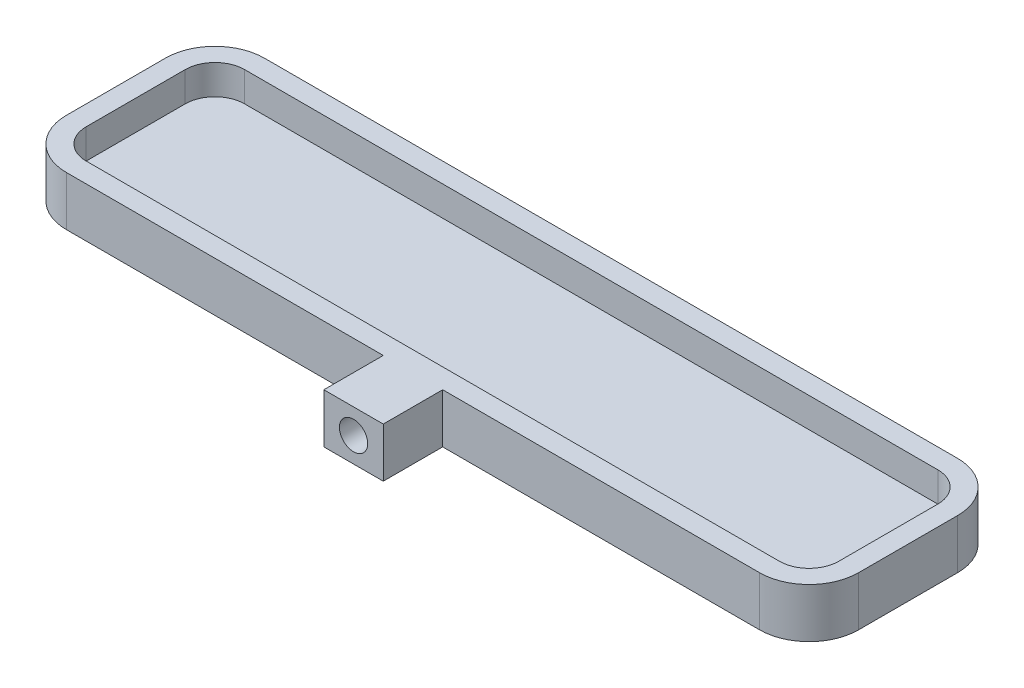
ISO-10303-21;
HEADER;
FILE_DESCRIPTION(('STEP AP214'),'2;1');
FILE_NAME('part.step','',(''),(''),'','','');
FILE_SCHEMA(('AUTOMOTIVE_DESIGN { 1 0 10303 214 1 1 1 1 }'));
ENDSEC;
DATA;
#1=APPLICATION_CONTEXT('core data for automotive mechanical design processes');
#2=APPLICATION_PROTOCOL_DEFINITION('international standard','automotive_design',2000,#1);
#3=PRODUCT_CONTEXT('',#1,'mechanical');
#4=PRODUCT('Part','Part','',(#3));
#5=PRODUCT_RELATED_PRODUCT_CATEGORY('part','',(#4));
#6=PRODUCT_DEFINITION_FORMATION('','',#4);
#7=PRODUCT_DEFINITION_CONTEXT('part definition',#1,'design');
#8=PRODUCT_DEFINITION('design','',#6,#7);
#9=PRODUCT_DEFINITION_SHAPE('','',#8);
#10=(LENGTH_UNIT() NAMED_UNIT(*) SI_UNIT(.MILLI.,.METRE.));
#11=(NAMED_UNIT(*) PLANE_ANGLE_UNIT() SI_UNIT($,.RADIAN.));
#12=(NAMED_UNIT(*) SI_UNIT($,.STERADIAN.) SOLID_ANGLE_UNIT());
#13=UNCERTAINTY_MEASURE_WITH_UNIT(LENGTH_MEASURE(1.E-05),#10,'distance_accuracy_value','');
#14=(GEOMETRIC_REPRESENTATION_CONTEXT(3) GLOBAL_UNCERTAINTY_ASSIGNED_CONTEXT((#13)) GLOBAL_UNIT_ASSIGNED_CONTEXT((#10,
#11,#12)) REPRESENTATION_CONTEXT('',''));
#15=CARTESIAN_POINT('',(0.,0.,0.));
#16=DIRECTION('',(0.,0.,1.));
#17=DIRECTION('',(1.,0.,0.));
#18=AXIS2_PLACEMENT_3D('',#15,#16,#17);
#19=CARTESIAN_POINT('',(-40.,5.,10.));
#20=DIRECTION('',(0.,0.,-1.));
#21=DIRECTION('',(-1.,0.,0.));
#22=AXIS2_PLACEMENT_3D('',#19,#20,#21);
#23=PLANE('',#22);
#24=DIRECTION('',(0.,-1.,0.));
#25=VECTOR('',#24,1.);
#26=CARTESIAN_POINT('',(-3.,5.,10.));
#27=LINE('',#26,#25);
#28=CARTESIAN_POINT('',(-3.,5.,10.));
#29=VERTEX_POINT('',#28);
#30=CARTESIAN_POINT('',(-3.,0.,10.));
#31=VERTEX_POINT('',#30);
#32=EDGE_CURVE('E63',#29,#31,#27,.T.);
#33=ORIENTED_EDGE('',*,*,#32,.F.);
#34=DIRECTION('',(1.,0.,0.));
#35=VECTOR('',#34,1.);
#36=CARTESIAN_POINT('',(-40.,5.,10.));
#37=LINE('',#36,#35);
#38=CARTESIAN_POINT('',(-35.,5.,10.));
#39=VERTEX_POINT('',#38);
#40=EDGE_CURVE('E309',#39,#29,#37,.T.);
#41=ORIENTED_EDGE('',*,*,#40,.F.);
#42=DIRECTION('',(0.,-1.,0.));
#43=VECTOR('',#42,1.);
#44=CARTESIAN_POINT('',(-35.,5.,10.));
#45=LINE('',#44,#43);
#46=CARTESIAN_POINT('',(-35.,0.,10.));
#47=VERTEX_POINT('',#46);
#48=EDGE_CURVE('E368',#39,#47,#45,.T.);
#49=ORIENTED_EDGE('',*,*,#48,.T.);
#50=DIRECTION('',(1.,0.,0.));
#51=VECTOR('',#50,1.);
#52=CARTESIAN_POINT('',(-40.,0.,10.));
#53=LINE('',#52,#51);
#54=EDGE_CURVE('E301',#47,#31,#53,.T.);
#55=ORIENTED_EDGE('',*,*,#54,.T.);
#56=EDGE_LOOP('',(#33,#41,#49,#55));
#57=FACE_BOUND('',#56,.T.);
#58=ADVANCED_FACE('F39',(#57),#23,.F.);
#59=DIRECTION('',(0.,1.,0.));
#60=VECTOR('',#59,1.);
#61=CARTESIAN_POINT('',(3.,5.,10.));
#62=LINE('',#61,#60);
#63=CARTESIAN_POINT('',(3.,0.,10.));
#64=VERTEX_POINT('',#63);
#65=CARTESIAN_POINT('',(3.,5.,10.));
#66=VERTEX_POINT('',#65);
#67=EDGE_CURVE('E201',#64,#66,#62,.T.);
#68=ORIENTED_EDGE('',*,*,#67,.F.);
#69=CARTESIAN_POINT('',(35.,0.,10.));
#70=VERTEX_POINT('',#69);
#71=EDGE_CURVE('E324',#64,#70,#53,.T.);
#72=ORIENTED_EDGE('',*,*,#71,.T.);
#73=DIRECTION('',(0.,-1.,0.));
#74=VECTOR('',#73,1.);
#75=CARTESIAN_POINT('',(35.,5.,10.));
#76=LINE('',#75,#74);
#77=CARTESIAN_POINT('',(35.,5.,10.));
#78=VERTEX_POINT('',#77);
#79=EDGE_CURVE('E365',#70,#78,#76,.F.);
#80=ORIENTED_EDGE('',*,*,#79,.T.);
#81=EDGE_CURVE('E55',#66,#78,#37,.T.);
#82=ORIENTED_EDGE('',*,*,#81,.F.);
#83=EDGE_LOOP('',(#68,#72,#80,#82));
#84=FACE_BOUND('',#83,.T.);
#85=ADVANCED_FACE('F445',(#84),#23,.F.);
#86=CARTESIAN_POINT('',(40.,5.,10.));
#87=DIRECTION('',(-1.,0.,0.));
#88=DIRECTION('',(0.,0.,1.));
#89=AXIS2_PLACEMENT_3D('',#86,#87,#88);
#90=PLANE('',#89);
#91=DIRECTION('',(0.,0.,-1.));
#92=VECTOR('',#91,1.);
#93=CARTESIAN_POINT('',(40.,0.,10.));
#94=LINE('',#93,#92);
#95=CARTESIAN_POINT('',(40.,0.,5.));
#96=VERTEX_POINT('',#95);
#97=CARTESIAN_POINT('',(40.,0.,-5.));
#98=VERTEX_POINT('',#97);
#99=EDGE_CURVE('E220',#96,#98,#94,.T.);
#100=ORIENTED_EDGE('',*,*,#99,.T.);
#101=DIRECTION('',(0.,-1.,0.));
#102=VECTOR('',#101,1.);
#103=CARTESIAN_POINT('',(40.,5.,-5.));
#104=LINE('',#103,#102);
#105=CARTESIAN_POINT('',(40.,5.,-5.));
#106=VERTEX_POINT('',#105);
#107=EDGE_CURVE('E11',#98,#106,#104,.F.);
#108=ORIENTED_EDGE('',*,*,#107,.T.);
#109=DIRECTION('',(0.,0.,-1.));
#110=VECTOR('',#109,1.);
#111=CARTESIAN_POINT('',(40.,5.,10.));
#112=LINE('',#111,#110);
#113=CARTESIAN_POINT('',(40.,5.,5.));
#114=VERTEX_POINT('',#113);
#115=EDGE_CURVE('E296',#114,#106,#112,.T.);
#116=ORIENTED_EDGE('',*,*,#115,.F.);
#117=DIRECTION('',(0.,-1.,0.));
#118=VECTOR('',#117,1.);
#119=CARTESIAN_POINT('',(40.,5.,5.));
#120=LINE('',#119,#118);
#121=EDGE_CURVE('E48',#114,#96,#120,.T.);
#122=ORIENTED_EDGE('',*,*,#121,.T.);
#123=EDGE_LOOP('',(#100,#108,#116,#122));
#124=FACE_BOUND('',#123,.T.);
#125=ADVANCED_FACE('F377',(#124),#90,.F.);
#126=CARTESIAN_POINT('',(-40.,5.,-10.));
#127=DIRECTION('',(0.,0.,1.));
#128=DIRECTION('',(1.,0.,0.));
#129=AXIS2_PLACEMENT_3D('',#126,#127,#128);
#130=PLANE('',#129);
#131=DIRECTION('',(-1.,0.,0.));
#132=VECTOR('',#131,1.);
#133=CARTESIAN_POINT('',(-40.,0.,-10.));
#134=LINE('',#133,#132);
#135=CARTESIAN_POINT('',(35.,0.,-10.));
#136=VERTEX_POINT('',#135);
#137=CARTESIAN_POINT('',(-35.,0.,-10.));
#138=VERTEX_POINT('',#137);
#139=EDGE_CURVE('E316',#136,#138,#134,.T.);
#140=ORIENTED_EDGE('',*,*,#139,.T.);
#141=DIRECTION('',(0.,-1.,0.));
#142=VECTOR('',#141,1.);
#143=CARTESIAN_POINT('',(-35.,5.,-10.));
#144=LINE('',#143,#142);
#145=CARTESIAN_POINT('',(-35.,5.,-10.));
#146=VERTEX_POINT('',#145);
#147=EDGE_CURVE('E350',#138,#146,#144,.F.);
#148=ORIENTED_EDGE('',*,*,#147,.T.);
#149=DIRECTION('',(-1.,0.,0.));
#150=VECTOR('',#149,1.);
#151=CARTESIAN_POINT('',(-40.,5.,-10.));
#152=LINE('',#151,#150);
#153=CARTESIAN_POINT('',(35.,5.,-10.));
#154=VERTEX_POINT('',#153);
#155=EDGE_CURVE('E300',#154,#146,#152,.T.);
#156=ORIENTED_EDGE('',*,*,#155,.F.);
#157=DIRECTION('',(0.,-1.,0.));
#158=VECTOR('',#157,1.);
#159=CARTESIAN_POINT('',(35.,5.,-10.));
#160=LINE('',#159,#158);
#161=EDGE_CURVE('E346',#154,#136,#160,.T.);
#162=ORIENTED_EDGE('',*,*,#161,.T.);
#163=EDGE_LOOP('',(#140,#148,#156,#162));
#164=FACE_BOUND('',#163,.T.);
#165=ADVANCED_FACE('F389',(#164),#130,.F.);
#166=CARTESIAN_POINT('',(-40.,5.,10.));
#167=DIRECTION('',(1.,0.,0.));
#168=DIRECTION('',(0.,0.,-1.));
#169=AXIS2_PLACEMENT_3D('',#166,#167,#168);
#170=PLANE('',#169);
#171=DIRECTION('',(0.,0.,1.));
#172=VECTOR('',#171,1.);
#173=CARTESIAN_POINT('',(-40.,5.,10.));
#174=LINE('',#173,#172);
#175=CARTESIAN_POINT('',(-40.,5.,-5.));
#176=VERTEX_POINT('',#175);
#177=CARTESIAN_POINT('',(-40.,5.,5.));
#178=VERTEX_POINT('',#177);
#179=EDGE_CURVE('E305',#176,#178,#174,.T.);
#180=ORIENTED_EDGE('',*,*,#179,.F.);
#181=DIRECTION('',(0.,-1.,0.));
#182=VECTOR('',#181,1.);
#183=CARTESIAN_POINT('',(-40.,5.,-5.));
#184=LINE('',#183,#182);
#185=CARTESIAN_POINT('',(-40.,0.,-5.));
#186=VERTEX_POINT('',#185);
#187=EDGE_CURVE('E329',#176,#186,#184,.T.);
#188=ORIENTED_EDGE('',*,*,#187,.T.);
#189=DIRECTION('',(0.,0.,1.));
#190=VECTOR('',#189,1.);
#191=CARTESIAN_POINT('',(-40.,0.,10.));
#192=LINE('',#191,#190);
#193=CARTESIAN_POINT('',(-40.,0.,5.));
#194=VERTEX_POINT('',#193);
#195=EDGE_CURVE('E320',#186,#194,#192,.T.);
#196=ORIENTED_EDGE('',*,*,#195,.T.);
#197=DIRECTION('',(0.,-1.,0.));
#198=VECTOR('',#197,1.);
#199=CARTESIAN_POINT('',(-40.,5.,5.));
#200=LINE('',#199,#198);
#201=EDGE_CURVE('E312',#194,#178,#200,.F.);
#202=ORIENTED_EDGE('',*,*,#201,.T.);
#203=EDGE_LOOP('',(#180,#188,#196,#202));
#204=FACE_BOUND('',#203,.T.);
#205=ADVANCED_FACE('F399',(#204),#170,.F.);
#206=CARTESIAN_POINT('',(0.,5.,0.));
#207=DIRECTION('',(0.,-1.,0.));
#208=DIRECTION('',(0.,0.,-1.));
#209=AXIS2_PLACEMENT_3D('',#206,#207,#208);
#210=PLANE('',#209);
#211=DIRECTION('',(-1.,0.,0.));
#212=VECTOR('',#211,1.);
#213=CARTESIAN_POINT('',(0.,5.,-8.));
#214=LINE('',#213,#212);
#215=CARTESIAN_POINT('',(35.,5.,-8.));
#216=VERTEX_POINT('',#215);
#217=CARTESIAN_POINT('',(-35.,5.,-8.));
#218=VERTEX_POINT('',#217);
#219=EDGE_CURVE('E275',#216,#218,#214,.T.);
#220=ORIENTED_EDGE('',*,*,#219,.F.);
#221=CARTESIAN_POINT('',(35.,5.,-5.));
#222=DIRECTION('',(0.,-1.,0.));
#223=DIRECTION('',(0.,0.,-1.));
#224=AXIS2_PLACEMENT_3D('',#221,#222,#223);
#225=CIRCLE('',#224,3.);
#226=CARTESIAN_POINT('',(38.,5.,-5.));
#227=VERTEX_POINT('',#226);
#228=EDGE_CURVE('E276',#227,#216,#225,.F.);
#229=ORIENTED_EDGE('',*,*,#228,.F.);
#230=DIRECTION('',(0.,0.,-1.));
#231=VECTOR('',#230,1.);
#232=CARTESIAN_POINT('',(38.,5.,0.));
#233=LINE('',#232,#231);
#234=CARTESIAN_POINT('',(38.,5.,5.));
#235=VERTEX_POINT('',#234);
#236=EDGE_CURVE('E249',#235,#227,#233,.T.);
#237=ORIENTED_EDGE('',*,*,#236,.F.);
#238=CARTESIAN_POINT('',(35.,5.,5.));
#239=DIRECTION('',(0.,-1.,0.));
#240=DIRECTION('',(0.,0.,-1.));
#241=AXIS2_PLACEMENT_3D('',#238,#239,#240);
#242=CIRCLE('',#241,3.);
#243=CARTESIAN_POINT('',(35.,5.,8.));
#244=VERTEX_POINT('',#243);
#245=EDGE_CURVE('E255',#244,#235,#242,.F.);
#246=ORIENTED_EDGE('',*,*,#245,.F.);
#247=DIRECTION('',(1.,0.,0.));
#248=VECTOR('',#247,1.);
#249=CARTESIAN_POINT('',(0.,5.,8.));
#250=LINE('',#249,#248);
#251=CARTESIAN_POINT('',(-35.,5.,8.));
#252=VERTEX_POINT('',#251);
#253=EDGE_CURVE('E265',#252,#244,#250,.T.);
#254=ORIENTED_EDGE('',*,*,#253,.F.);
#255=CARTESIAN_POINT('',(-35.,5.,5.));
#256=DIRECTION('',(0.,-1.,0.));
#257=DIRECTION('',(0.,0.,-1.));
#258=AXIS2_PLACEMENT_3D('',#255,#256,#257);
#259=CIRCLE('',#258,3.);
#260=CARTESIAN_POINT('',(-38.,5.,5.));
#261=VERTEX_POINT('',#260);
#262=EDGE_CURVE('E279',#261,#252,#259,.F.);
#263=ORIENTED_EDGE('',*,*,#262,.F.);
#264=DIRECTION('',(0.,0.,1.));
#265=VECTOR('',#264,1.);
#266=CARTESIAN_POINT('',(-38.,5.,0.));
#267=LINE('',#266,#265);
#268=CARTESIAN_POINT('',(-38.,5.,-5.));
#269=VERTEX_POINT('',#268);
#270=EDGE_CURVE('E283',#269,#261,#267,.T.);
#271=ORIENTED_EDGE('',*,*,#270,.F.);
#272=CARTESIAN_POINT('',(-35.,5.,-5.));
#273=DIRECTION('',(0.,-1.,0.));
#274=DIRECTION('',(0.,0.,-1.));
#275=AXIS2_PLACEMENT_3D('',#272,#273,#274);
#276=CIRCLE('',#275,3.);
#277=EDGE_CURVE('E272',#218,#269,#276,.F.);
#278=ORIENTED_EDGE('',*,*,#277,.F.);
#279=EDGE_LOOP('',(#220,#229,#237,#246,#254,#263,#271,#278));
#280=FACE_BOUND('',#279,.T.);
#281=ORIENTED_EDGE('',*,*,#155,.T.);
#282=CARTESIAN_POINT('',(-35.,5.,-5.));
#283=DIRECTION('',(0.,-1.,0.));
#284=DIRECTION('',(0.,0.,-1.));
#285=AXIS2_PLACEMENT_3D('',#282,#283,#284);
#286=CIRCLE('',#285,5.);
#287=EDGE_CURVE('E362',#146,#176,#286,.F.);
#288=ORIENTED_EDGE('',*,*,#287,.T.);
#289=ORIENTED_EDGE('',*,*,#179,.T.);
#290=CARTESIAN_POINT('',(-35.,5.,5.));
#291=DIRECTION('',(0.,-1.,0.));
#292=DIRECTION('',(0.,0.,-1.));
#293=AXIS2_PLACEMENT_3D('',#290,#291,#292);
#294=CIRCLE('',#293,5.);
#295=EDGE_CURVE('E359',#178,#39,#294,.F.);
#296=ORIENTED_EDGE('',*,*,#295,.T.);
#297=ORIENTED_EDGE('',*,*,#40,.T.);
#298=DIRECTION('',(0.,0.,-1.));
#299=VECTOR('',#298,1.);
#300=CARTESIAN_POINT('',(-3.,5.,16.));
#301=LINE('',#300,#299);
#302=CARTESIAN_POINT('',(-3.,5.,16.));
#303=VERTEX_POINT('',#302);
#304=EDGE_CURVE('E405',#303,#29,#301,.T.);
#305=ORIENTED_EDGE('',*,*,#304,.F.);
#306=DIRECTION('',(-1.,0.,0.));
#307=VECTOR('',#306,1.);
#308=CARTESIAN_POINT('',(-3.,5.,16.));
#309=LINE('',#308,#307);
#310=CARTESIAN_POINT('',(3.,5.,16.));
#311=VERTEX_POINT('',#310);
#312=EDGE_CURVE('E196',#311,#303,#309,.T.);
#313=ORIENTED_EDGE('',*,*,#312,.F.);
#314=DIRECTION('',(0.,0.,-1.));
#315=VECTOR('',#314,1.);
#316=CARTESIAN_POINT('',(3.,5.,16.));
#317=LINE('',#316,#315);
#318=EDGE_CURVE('E212',#311,#66,#317,.T.);
#319=ORIENTED_EDGE('',*,*,#318,.T.);
#320=ORIENTED_EDGE('',*,*,#81,.T.);
#321=CARTESIAN_POINT('',(35.,5.,5.));
#322=DIRECTION('',(0.,-1.,0.));
#323=DIRECTION('',(0.,0.,-1.));
#324=AXIS2_PLACEMENT_3D('',#321,#322,#323);
#325=CIRCLE('',#324,5.);
#326=EDGE_CURVE('E353',#78,#114,#325,.F.);
#327=ORIENTED_EDGE('',*,*,#326,.T.);
#328=ORIENTED_EDGE('',*,*,#115,.T.);
#329=CARTESIAN_POINT('',(35.,5.,-5.));
#330=DIRECTION('',(0.,-1.,0.));
#331=DIRECTION('',(0.,0.,-1.));
#332=AXIS2_PLACEMENT_3D('',#329,#330,#331);
#333=CIRCLE('',#332,5.);
#334=EDGE_CURVE('E356',#106,#154,#333,.F.);
#335=ORIENTED_EDGE('',*,*,#334,.T.);
#336=EDGE_LOOP('',(#281,#288,#289,#296,#297,#305,#313,#319,#320,#327,#328,#335));
#337=FACE_BOUND('',#336,.T.);
#338=ADVANCED_FACE('F393',(#280,#337),#210,.F.);
#339=CARTESIAN_POINT('',(0.,0.,0.));
#340=DIRECTION('',(0.,-1.,0.));
#341=DIRECTION('',(0.,0.,-1.));
#342=AXIS2_PLACEMENT_3D('',#339,#340,#341);
#343=PLANE('',#342);
#344=ORIENTED_EDGE('',*,*,#195,.F.);
#345=CARTESIAN_POINT('',(-35.,0.,-5.));
#346=DIRECTION('',(0.,-1.,0.));
#347=DIRECTION('',(0.,0.,-1.));
#348=AXIS2_PLACEMENT_3D('',#345,#346,#347);
#349=CIRCLE('',#348,5.);
#350=EDGE_CURVE('E343',#186,#138,#349,.T.);
#351=ORIENTED_EDGE('',*,*,#350,.T.);
#352=ORIENTED_EDGE('',*,*,#139,.F.);
#353=CARTESIAN_POINT('',(35.,0.,-5.));
#354=DIRECTION('',(0.,-1.,0.));
#355=DIRECTION('',(0.,0.,-1.));
#356=AXIS2_PLACEMENT_3D('',#353,#354,#355);
#357=CIRCLE('',#356,5.);
#358=EDGE_CURVE('E337',#136,#98,#357,.T.);
#359=ORIENTED_EDGE('',*,*,#358,.T.);
#360=ORIENTED_EDGE('',*,*,#99,.F.);
#361=CARTESIAN_POINT('',(35.,0.,5.));
#362=DIRECTION('',(0.,-1.,0.));
#363=DIRECTION('',(0.,0.,-1.));
#364=AXIS2_PLACEMENT_3D('',#361,#362,#363);
#365=CIRCLE('',#364,5.);
#366=EDGE_CURVE('E333',#96,#70,#365,.T.);
#367=ORIENTED_EDGE('',*,*,#366,.T.);
#368=ORIENTED_EDGE('',*,*,#71,.F.);
#369=DIRECTION('',(0.,0.,-1.));
#370=VECTOR('',#369,1.);
#371=CARTESIAN_POINT('',(3.,0.,16.));
#372=LINE('',#371,#370);
#373=CARTESIAN_POINT('',(3.,0.,16.));
#374=VERTEX_POINT('',#373);
#375=EDGE_CURVE('E186',#374,#64,#372,.T.);
#376=ORIENTED_EDGE('',*,*,#375,.F.);
#377=DIRECTION('',(1.,0.,0.));
#378=VECTOR('',#377,1.);
#379=CARTESIAN_POINT('',(-3.,0.,16.));
#380=LINE('',#379,#378);
#381=CARTESIAN_POINT('',(-3.,0.,16.));
#382=VERTEX_POINT('',#381);
#383=EDGE_CURVE('E178',#382,#374,#380,.T.);
#384=ORIENTED_EDGE('',*,*,#383,.F.);
#385=DIRECTION('',(0.,0.,-1.));
#386=VECTOR('',#385,1.);
#387=CARTESIAN_POINT('',(-3.,0.,16.));
#388=LINE('',#387,#386);
#389=EDGE_CURVE('E184',#382,#31,#388,.T.);
#390=ORIENTED_EDGE('',*,*,#389,.T.);
#391=ORIENTED_EDGE('',*,*,#54,.F.);
#392=CARTESIAN_POINT('',(-35.,0.,5.));
#393=DIRECTION('',(0.,-1.,0.));
#394=DIRECTION('',(0.,0.,-1.));
#395=AXIS2_PLACEMENT_3D('',#392,#393,#394);
#396=CIRCLE('',#395,5.);
#397=EDGE_CURVE('E340',#47,#194,#396,.T.);
#398=ORIENTED_EDGE('',*,*,#397,.T.);
#399=EDGE_LOOP('',(#344,#351,#352,#359,#360,#367,#368,#376,#384,#390,#391,#398));
#400=FACE_BOUND('',#399,.T.);
#401=ADVANCED_FACE('F181',(#400),#343,.T.);
#402=CARTESIAN_POINT('',(-35.,5.,-5.));
#403=DIRECTION('',(0.,-1.,0.));
#404=DIRECTION('',(0.,0.,-1.));
#405=AXIS2_PLACEMENT_3D('',#402,#403,#404);
#406=CYLINDRICAL_SURFACE('',#405,5.);
#407=ORIENTED_EDGE('',*,*,#287,.F.);
#408=ORIENTED_EDGE('',*,*,#147,.F.);
#409=ORIENTED_EDGE('',*,*,#350,.F.);
#410=ORIENTED_EDGE('',*,*,#187,.F.);
#411=EDGE_LOOP('',(#407,#408,#409,#410));
#412=FACE_BOUND('',#411,.T.);
#413=ADVANCED_FACE('F397',(#412),#406,.T.);
#414=CARTESIAN_POINT('',(-35.,5.,5.));
#415=DIRECTION('',(0.,-1.,0.));
#416=DIRECTION('',(0.,0.,-1.));
#417=AXIS2_PLACEMENT_3D('',#414,#415,#416);
#418=CYLINDRICAL_SURFACE('',#417,5.);
#419=ORIENTED_EDGE('',*,*,#295,.F.);
#420=ORIENTED_EDGE('',*,*,#201,.F.);
#421=ORIENTED_EDGE('',*,*,#397,.F.);
#422=ORIENTED_EDGE('',*,*,#48,.F.);
#423=EDGE_LOOP('',(#419,#420,#421,#422));
#424=FACE_BOUND('',#423,.T.);
#425=ADVANCED_FACE('F404',(#424),#418,.T.);
#426=CARTESIAN_POINT('',(35.,5.,-5.));
#427=DIRECTION('',(0.,-1.,0.));
#428=DIRECTION('',(0.,0.,-1.));
#429=AXIS2_PLACEMENT_3D('',#426,#427,#428);
#430=CYLINDRICAL_SURFACE('',#429,5.);
#431=ORIENTED_EDGE('',*,*,#334,.F.);
#432=ORIENTED_EDGE('',*,*,#107,.F.);
#433=ORIENTED_EDGE('',*,*,#358,.F.);
#434=ORIENTED_EDGE('',*,*,#161,.F.);
#435=EDGE_LOOP('',(#431,#432,#433,#434));
#436=FACE_BOUND('',#435,.T.);
#437=ADVANCED_FACE('F386',(#436),#430,.T.);
#438=CARTESIAN_POINT('',(35.,5.,5.));
#439=DIRECTION('',(0.,-1.,0.));
#440=DIRECTION('',(0.,0.,-1.));
#441=AXIS2_PLACEMENT_3D('',#438,#439,#440);
#442=CYLINDRICAL_SURFACE('',#441,5.);
#443=ORIENTED_EDGE('',*,*,#326,.F.);
#444=ORIENTED_EDGE('',*,*,#79,.F.);
#445=ORIENTED_EDGE('',*,*,#366,.F.);
#446=ORIENTED_EDGE('',*,*,#121,.F.);
#447=EDGE_LOOP('',(#443,#444,#445,#446));
#448=FACE_BOUND('',#447,.T.);
#449=ADVANCED_FACE('F41',(#448),#442,.T.);
#450=CARTESIAN_POINT('',(38.,5.,10.));
#451=DIRECTION('',(-1.,0.,0.));
#452=DIRECTION('',(0.,0.,1.));
#453=AXIS2_PLACEMENT_3D('',#450,#451,#452);
#454=PLANE('',#453);
#455=DIRECTION('',(0.,0.,-1.));
#456=VECTOR('',#455,1.);
#457=CARTESIAN_POINT('',(38.,2.,0.));
#458=LINE('',#457,#456);
#459=CARTESIAN_POINT('',(38.,2.,5.));
#460=VERTEX_POINT('',#459);
#461=CARTESIAN_POINT('',(38.,2.,-5.));
#462=VERTEX_POINT('',#461);
#463=EDGE_CURVE('E205',#460,#462,#458,.T.);
#464=ORIENTED_EDGE('',*,*,#463,.F.);
#465=DIRECTION('',(0.,1.,0.));
#466=VECTOR('',#465,1.);
#467=CARTESIAN_POINT('',(38.,5.,5.));
#468=LINE('',#467,#466);
#469=EDGE_CURVE('E221',#235,#460,#468,.F.);
#470=ORIENTED_EDGE('',*,*,#469,.F.);
#471=ORIENTED_EDGE('',*,*,#236,.T.);
#472=DIRECTION('',(0.,1.,0.));
#473=VECTOR('',#472,1.);
#474=CARTESIAN_POINT('',(38.,5.,-5.));
#475=LINE('',#474,#473);
#476=EDGE_CURVE('E216',#462,#227,#475,.T.);
#477=ORIENTED_EDGE('',*,*,#476,.F.);
#478=EDGE_LOOP('',(#464,#470,#471,#477));
#479=FACE_BOUND('',#478,.T.);
#480=ADVANCED_FACE('F466',(#479),#454,.T.);
#481=CARTESIAN_POINT('',(-40.,5.,-8.));
#482=DIRECTION('',(0.,0.,1.));
#483=DIRECTION('',(1.,0.,0.));
#484=AXIS2_PLACEMENT_3D('',#481,#482,#483);
#485=PLANE('',#484);
#486=DIRECTION('',(-1.,0.,0.));
#487=VECTOR('',#486,1.);
#488=CARTESIAN_POINT('',(0.,2.,-8.));
#489=LINE('',#488,#487);
#490=CARTESIAN_POINT('',(35.,2.,-8.));
#491=VERTEX_POINT('',#490);
#492=CARTESIAN_POINT('',(-35.,2.,-8.));
#493=VERTEX_POINT('',#492);
#494=EDGE_CURVE('E210',#491,#493,#489,.T.);
#495=ORIENTED_EDGE('',*,*,#494,.F.);
#496=DIRECTION('',(0.,1.,0.));
#497=VECTOR('',#496,1.);
#498=CARTESIAN_POINT('',(35.,5.,-8.));
#499=LINE('',#498,#497);
#500=EDGE_CURVE('E234',#216,#491,#499,.F.);
#501=ORIENTED_EDGE('',*,*,#500,.F.);
#502=ORIENTED_EDGE('',*,*,#219,.T.);
#503=DIRECTION('',(0.,1.,0.));
#504=VECTOR('',#503,1.);
#505=CARTESIAN_POINT('',(-35.,5.,-8.));
#506=LINE('',#505,#504);
#507=EDGE_CURVE('E252',#493,#218,#506,.T.);
#508=ORIENTED_EDGE('',*,*,#507,.F.);
#509=EDGE_LOOP('',(#495,#501,#502,#508));
#510=FACE_BOUND('',#509,.T.);
#511=ADVANCED_FACE('F470',(#510),#485,.T.);
#512=CARTESIAN_POINT('',(-38.,5.,10.));
#513=DIRECTION('',(1.,0.,0.));
#514=DIRECTION('',(0.,0.,-1.));
#515=AXIS2_PLACEMENT_3D('',#512,#513,#514);
#516=PLANE('',#515);
#517=ORIENTED_EDGE('',*,*,#270,.T.);
#518=DIRECTION('',(0.,1.,0.));
#519=VECTOR('',#518,1.);
#520=CARTESIAN_POINT('',(-38.,5.,5.));
#521=LINE('',#520,#519);
#522=CARTESIAN_POINT('',(-38.,2.,5.));
#523=VERTEX_POINT('',#522);
#524=EDGE_CURVE('E262',#523,#261,#521,.T.);
#525=ORIENTED_EDGE('',*,*,#524,.F.);
#526=DIRECTION('',(0.,0.,1.));
#527=VECTOR('',#526,1.);
#528=CARTESIAN_POINT('',(-38.,2.,0.));
#529=LINE('',#528,#527);
#530=CARTESIAN_POINT('',(-38.,2.,-5.));
#531=VERTEX_POINT('',#530);
#532=EDGE_CURVE('E226',#531,#523,#529,.T.);
#533=ORIENTED_EDGE('',*,*,#532,.F.);
#534=DIRECTION('',(0.,1.,0.));
#535=VECTOR('',#534,1.);
#536=CARTESIAN_POINT('',(-38.,5.,-5.));
#537=LINE('',#536,#535);
#538=EDGE_CURVE('E245',#269,#531,#537,.F.);
#539=ORIENTED_EDGE('',*,*,#538,.F.);
#540=EDGE_LOOP('',(#517,#525,#533,#539));
#541=FACE_BOUND('',#540,.T.);
#542=ADVANCED_FACE('F479',(#541),#516,.T.);
#543=CARTESIAN_POINT('',(-40.,5.,8.));
#544=DIRECTION('',(0.,0.,-1.));
#545=DIRECTION('',(-1.,0.,0.));
#546=AXIS2_PLACEMENT_3D('',#543,#544,#545);
#547=PLANE('',#546);
#548=ORIENTED_EDGE('',*,*,#253,.T.);
#549=DIRECTION('',(0.,1.,0.));
#550=VECTOR('',#549,1.);
#551=CARTESIAN_POINT('',(35.,5.,8.));
#552=LINE('',#551,#550);
#553=CARTESIAN_POINT('',(35.,2.,8.));
#554=VERTEX_POINT('',#553);
#555=EDGE_CURVE('E269',#554,#244,#552,.T.);
#556=ORIENTED_EDGE('',*,*,#555,.F.);
#557=DIRECTION('',(1.,0.,0.));
#558=VECTOR('',#557,1.);
#559=CARTESIAN_POINT('',(0.,2.,8.));
#560=LINE('',#559,#558);
#561=CARTESIAN_POINT('',(-35.,2.,8.));
#562=VERTEX_POINT('',#561);
#563=EDGE_CURVE('E230',#562,#554,#560,.T.);
#564=ORIENTED_EDGE('',*,*,#563,.F.);
#565=DIRECTION('',(0.,1.,0.));
#566=VECTOR('',#565,1.);
#567=CARTESIAN_POINT('',(-35.,5.,8.));
#568=LINE('',#567,#566);
#569=EDGE_CURVE('E225',#252,#562,#568,.F.);
#570=ORIENTED_EDGE('',*,*,#569,.F.);
#571=EDGE_LOOP('',(#548,#556,#564,#570));
#572=FACE_BOUND('',#571,.T.);
#573=ADVANCED_FACE('F487',(#572),#547,.T.);
#574=CARTESIAN_POINT('',(0.,2.,0.));
#575=DIRECTION('',(0.,-1.,0.));
#576=DIRECTION('',(0.,0.,-1.));
#577=AXIS2_PLACEMENT_3D('',#574,#575,#576);
#578=PLANE('',#577);
#579=ORIENTED_EDGE('',*,*,#532,.T.);
#580=CARTESIAN_POINT('',(-35.,2.,5.));
#581=DIRECTION('',(0.,-1.,0.));
#582=DIRECTION('',(0.,0.,-1.));
#583=AXIS2_PLACEMENT_3D('',#580,#581,#582);
#584=CIRCLE('',#583,3.);
#585=EDGE_CURVE('E235',#562,#523,#584,.T.);
#586=ORIENTED_EDGE('',*,*,#585,.F.);
#587=ORIENTED_EDGE('',*,*,#563,.T.);
#588=CARTESIAN_POINT('',(35.,2.,5.));
#589=DIRECTION('',(0.,-1.,0.));
#590=DIRECTION('',(0.,0.,-1.));
#591=AXIS2_PLACEMENT_3D('',#588,#589,#590);
#592=CIRCLE('',#591,3.);
#593=EDGE_CURVE('E242',#460,#554,#592,.T.);
#594=ORIENTED_EDGE('',*,*,#593,.F.);
#595=ORIENTED_EDGE('',*,*,#463,.T.);
#596=CARTESIAN_POINT('',(35.,2.,-5.));
#597=DIRECTION('',(0.,-1.,0.));
#598=DIRECTION('',(0.,0.,-1.));
#599=AXIS2_PLACEMENT_3D('',#596,#597,#598);
#600=CIRCLE('',#599,3.);
#601=EDGE_CURVE('E239',#491,#462,#600,.T.);
#602=ORIENTED_EDGE('',*,*,#601,.F.);
#603=ORIENTED_EDGE('',*,*,#494,.T.);
#604=CARTESIAN_POINT('',(-35.,2.,-5.));
#605=DIRECTION('',(0.,-1.,0.));
#606=DIRECTION('',(0.,0.,-1.));
#607=AXIS2_PLACEMENT_3D('',#604,#605,#606);
#608=CIRCLE('',#607,3.);
#609=EDGE_CURVE('E231',#531,#493,#608,.T.);
#610=ORIENTED_EDGE('',*,*,#609,.F.);
#611=EDGE_LOOP('',(#579,#586,#587,#594,#595,#602,#603,#610));
#612=FACE_BOUND('',#611,.T.);
#613=ADVANCED_FACE('F491',(#612),#578,.F.);
#614=CARTESIAN_POINT('',(-35.,5.,-5.));
#615=DIRECTION('',(0.,-1.,0.));
#616=DIRECTION('',(0.,0.,-1.));
#617=AXIS2_PLACEMENT_3D('',#614,#615,#616);
#618=CYLINDRICAL_SURFACE('',#617,3.);
#619=ORIENTED_EDGE('',*,*,#277,.T.);
#620=ORIENTED_EDGE('',*,*,#538,.T.);
#621=ORIENTED_EDGE('',*,*,#609,.T.);
#622=ORIENTED_EDGE('',*,*,#507,.T.);
#623=EDGE_LOOP('',(#619,#620,#621,#622));
#624=FACE_BOUND('',#623,.T.);
#625=ADVANCED_FACE('F495',(#624),#618,.F.);
#626=CARTESIAN_POINT('',(-35.,5.,5.));
#627=DIRECTION('',(0.,-1.,0.));
#628=DIRECTION('',(0.,0.,-1.));
#629=AXIS2_PLACEMENT_3D('',#626,#627,#628);
#630=CYLINDRICAL_SURFACE('',#629,3.);
#631=ORIENTED_EDGE('',*,*,#262,.T.);
#632=ORIENTED_EDGE('',*,*,#569,.T.);
#633=ORIENTED_EDGE('',*,*,#585,.T.);
#634=ORIENTED_EDGE('',*,*,#524,.T.);
#635=EDGE_LOOP('',(#631,#632,#633,#634));
#636=FACE_BOUND('',#635,.T.);
#637=ADVANCED_FACE('F499',(#636),#630,.F.);
#638=CARTESIAN_POINT('',(35.,5.,-5.));
#639=DIRECTION('',(0.,-1.,0.));
#640=DIRECTION('',(0.,0.,-1.));
#641=AXIS2_PLACEMENT_3D('',#638,#639,#640);
#642=CYLINDRICAL_SURFACE('',#641,3.);
#643=ORIENTED_EDGE('',*,*,#228,.T.);
#644=ORIENTED_EDGE('',*,*,#500,.T.);
#645=ORIENTED_EDGE('',*,*,#601,.T.);
#646=ORIENTED_EDGE('',*,*,#476,.T.);
#647=EDGE_LOOP('',(#643,#644,#645,#646));
#648=FACE_BOUND('',#647,.T.);
#649=ADVANCED_FACE('F503',(#648),#642,.F.);
#650=CARTESIAN_POINT('',(35.,5.,5.));
#651=DIRECTION('',(0.,-1.,0.));
#652=DIRECTION('',(0.,0.,-1.));
#653=AXIS2_PLACEMENT_3D('',#650,#651,#652);
#654=CYLINDRICAL_SURFACE('',#653,3.);
#655=ORIENTED_EDGE('',*,*,#245,.T.);
#656=ORIENTED_EDGE('',*,*,#469,.T.);
#657=ORIENTED_EDGE('',*,*,#593,.T.);
#658=ORIENTED_EDGE('',*,*,#555,.T.);
#659=EDGE_LOOP('',(#655,#656,#657,#658));
#660=FACE_BOUND('',#659,.T.);
#661=ADVANCED_FACE('F507',(#660),#654,.F.);
#662=CARTESIAN_POINT('',(-3.,5.,16.));
#663=DIRECTION('',(1.,0.,0.));
#664=DIRECTION('',(0.,1.,0.));
#665=AXIS2_PLACEMENT_3D('',#662,#663,#664);
#666=PLANE('',#665);
#667=ORIENTED_EDGE('',*,*,#32,.T.);
#668=ORIENTED_EDGE('',*,*,#389,.F.);
#669=DIRECTION('',(0.,-1.,0.));
#670=VECTOR('',#669,1.);
#671=CARTESIAN_POINT('',(-3.,5.,16.));
#672=LINE('',#671,#670);
#673=EDGE_CURVE('E191',#303,#382,#672,.T.);
#674=ORIENTED_EDGE('',*,*,#673,.F.);
#675=ORIENTED_EDGE('',*,*,#304,.T.);
#676=EDGE_LOOP('',(#667,#668,#674,#675));
#677=FACE_BOUND('',#676,.T.);
#678=ADVANCED_FACE('F203',(#677),#666,.F.);
#679=CARTESIAN_POINT('',(3.,5.,16.));
#680=DIRECTION('',(-1.,0.,0.));
#681=DIRECTION('',(0.,-1.,0.));
#682=AXIS2_PLACEMENT_3D('',#679,#680,#681);
#683=PLANE('',#682);
#684=ORIENTED_EDGE('',*,*,#67,.T.);
#685=ORIENTED_EDGE('',*,*,#318,.F.);
#686=DIRECTION('',(0.,1.,0.));
#687=VECTOR('',#686,1.);
#688=CARTESIAN_POINT('',(3.,5.,16.));
#689=LINE('',#688,#687);
#690=EDGE_CURVE('E190',#374,#311,#689,.T.);
#691=ORIENTED_EDGE('',*,*,#690,.F.);
#692=ORIENTED_EDGE('',*,*,#375,.T.);
#693=EDGE_LOOP('',(#684,#685,#691,#692));
#694=FACE_BOUND('',#693,.T.);
#695=ADVANCED_FACE('F437',(#694),#683,.F.);
#696=CARTESIAN_POINT('',(0.,0.,16.));
#697=DIRECTION('',(0.,0.,1.));
#698=DIRECTION('',(1.,0.,0.));
#699=AXIS2_PLACEMENT_3D('',#696,#697,#698);
#700=PLANE('',#699);
#701=CARTESIAN_POINT('',(0.,2.5,16.));
#702=DIRECTION('',(0.,0.,1.));
#703=DIRECTION('',(1.,0.,0.));
#704=AXIS2_PLACEMENT_3D('',#701,#702,#703);
#705=CIRCLE('',#704,1.425);
#706=CARTESIAN_POINT('',(1.425,2.5,16.));
#707=VERTEX_POINT('',#706);
#708=EDGE_CURVE('E420',#707,#707,#705,.T.);
#709=ORIENTED_EDGE('',*,*,#708,.F.);
#710=EDGE_LOOP('',(#709));
#711=FACE_BOUND('',#710,.T.);
#712=ORIENTED_EDGE('',*,*,#673,.T.);
#713=ORIENTED_EDGE('',*,*,#383,.T.);
#714=ORIENTED_EDGE('',*,*,#690,.T.);
#715=ORIENTED_EDGE('',*,*,#312,.T.);
#716=EDGE_LOOP('',(#712,#713,#714,#715));
#717=FACE_BOUND('',#716,.T.);
#718=ADVANCED_FACE('F194',(#711,#717),#700,.T.);
#719=CARTESIAN_POINT('',(0.,2.5,12.));
#720=DIRECTION('',(0.,0.,1.));
#721=DIRECTION('',(1.,0.,0.));
#722=AXIS2_PLACEMENT_3D('',#719,#720,#721);
#723=CYLINDRICAL_SURFACE('',#722,1.425);
#724=CARTESIAN_POINT('',(0.,2.5,12.));
#725=DIRECTION('',(0.,0.,1.));
#726=DIRECTION('',(1.,0.,0.));
#727=AXIS2_PLACEMENT_3D('',#724,#725,#726);
#728=CIRCLE('',#727,1.425);
#729=CARTESIAN_POINT('',(1.425,2.5,12.));
#730=VERTEX_POINT('',#729);
#731=EDGE_CURVE('E416',#730,#730,#728,.T.);
#732=ORIENTED_EDGE('',*,*,#731,.F.);
#733=EDGE_LOOP('',(#732));
#734=FACE_BOUND('',#733,.T.);
#735=ORIENTED_EDGE('',*,*,#708,.T.);
#736=EDGE_LOOP('',(#735));
#737=FACE_BOUND('',#736,.T.);
#738=ADVANCED_FACE('F430',(#734,#737),#723,.F.);
#739=CARTESIAN_POINT('',(0.,2.5,12.));
#740=DIRECTION('',(0.,0.,1.));
#741=DIRECTION('',(1.,0.,0.));
#742=AXIS2_PLACEMENT_3D('',#739,#740,#741);
#743=PLANE('',#742);
#744=ORIENTED_EDGE('',*,*,#731,.T.);
#745=EDGE_LOOP('',(#744));
#746=FACE_BOUND('',#745,.T.);
#747=ADVANCED_FACE('F428',(#746),#743,.T.);
#748=CLOSED_SHELL('',(#58,#85,#125,#165,#205,#338,#401,#413,#425,#437,#449,#480,#511,#542,#573,
#613,#625,#637,#649,#661,#678,#695,#718,#738,#747));
#749=MANIFOLD_SOLID_BREP('B2',#748);
#750=ADVANCED_BREP_SHAPE_REPRESENTATION('',(#18,#749),#14);
#751=SHAPE_DEFINITION_REPRESENTATION(#9,#750);
ENDSEC;
END-ISO-10303-21;
